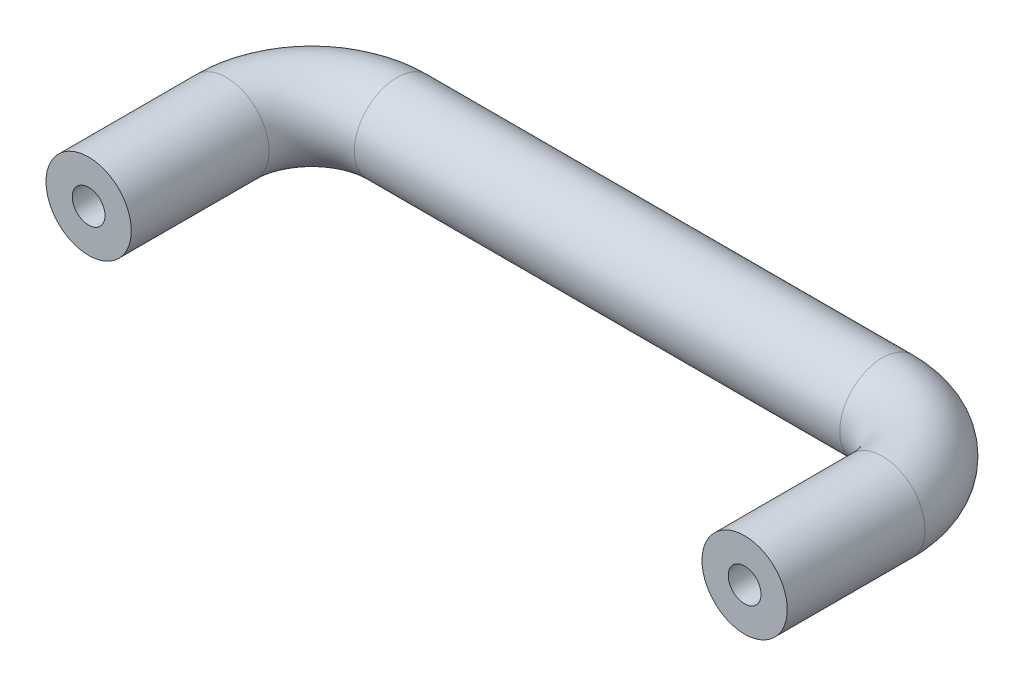
ISO-10303-21;
HEADER;
FILE_DESCRIPTION(('STEP AP214'),'2;1');
FILE_NAME('part.step','',(''),(''),'','','');
FILE_SCHEMA(('AUTOMOTIVE_DESIGN { 1 0 10303 214 1 1 1 1 }'));
ENDSEC;
DATA;
#1=APPLICATION_CONTEXT('core data for automotive mechanical design processes');
#2=APPLICATION_PROTOCOL_DEFINITION('international standard','automotive_design',2000,#1);
#3=PRODUCT_CONTEXT('',#1,'mechanical');
#4=PRODUCT('Part','Part','',(#3));
#5=PRODUCT_RELATED_PRODUCT_CATEGORY('part','',(#4));
#6=PRODUCT_DEFINITION_FORMATION('','',#4);
#7=PRODUCT_DEFINITION_CONTEXT('part definition',#1,'design');
#8=PRODUCT_DEFINITION('design','',#6,#7);
#9=PRODUCT_DEFINITION_SHAPE('','',#8);
#10=(LENGTH_UNIT() NAMED_UNIT(*) SI_UNIT(.MILLI.,.METRE.));
#11=(NAMED_UNIT(*) PLANE_ANGLE_UNIT() SI_UNIT($,.RADIAN.));
#12=(NAMED_UNIT(*) SI_UNIT($,.STERADIAN.) SOLID_ANGLE_UNIT());
#13=UNCERTAINTY_MEASURE_WITH_UNIT(LENGTH_MEASURE(1.E-05),#10,'distance_accuracy_value','');
#14=(GEOMETRIC_REPRESENTATION_CONTEXT(3) GLOBAL_UNCERTAINTY_ASSIGNED_CONTEXT((#13)) GLOBAL_UNIT_ASSIGNED_CONTEXT((#10,
#11,#12)) REPRESENTATION_CONTEXT('',''));
#15=CARTESIAN_POINT('',(0.,0.,0.));
#16=DIRECTION('',(0.,0.,1.));
#17=DIRECTION('',(1.,0.,0.));
#18=AXIS2_PLACEMENT_3D('',#15,#16,#17);
#19=CARTESIAN_POINT('',(50.,0.,34.));
#20=DIRECTION('',(0.,0.,-1.));
#21=DIRECTION('',(-1.,0.,0.));
#22=AXIS2_PLACEMENT_3D('',#19,#20,#21);
#23=PLANE('',#22);
#24=CARTESIAN_POINT('',(50.,0.,34.));
#25=DIRECTION('',(0.,0.,-1.));
#26=DIRECTION('',(-1.,0.,0.));
#27=AXIS2_PLACEMENT_3D('',#24,#25,#26);
#28=CIRCLE('',#27,6.5);
#29=CARTESIAN_POINT('',(43.5,0.,34.));
#30=VERTEX_POINT('',#29);
#31=EDGE_CURVE('E12',#30,#30,#28,.T.);
#32=ORIENTED_EDGE('',*,*,#31,.F.);
#33=EDGE_LOOP('',(#32));
#34=FACE_BOUND('',#33,.T.);
#35=CARTESIAN_POINT('',(50.,0.,34.));
#36=DIRECTION('',(0.,0.,1.));
#37=DIRECTION('',(1.,0.,0.));
#38=AXIS2_PLACEMENT_3D('',#35,#36,#37);
#39=CIRCLE('',#38,2.5);
#40=CARTESIAN_POINT('',(52.5,0.,34.));
#41=VERTEX_POINT('',#40);
#42=EDGE_CURVE('E79',#41,#41,#39,.T.);
#43=ORIENTED_EDGE('',*,*,#42,.F.);
#44=EDGE_LOOP('',(#43));
#45=FACE_BOUND('',#44,.T.);
#46=ADVANCED_FACE('F46',(#34,#45),#23,.F.);
#47=CARTESIAN_POINT('',(-50.,0.,34.));
#48=DIRECTION('',(0.,0.,1.));
#49=DIRECTION('',(1.,0.,0.));
#50=AXIS2_PLACEMENT_3D('',#47,#48,#49);
#51=PLANE('',#50);
#52=CARTESIAN_POINT('',(-50.,0.,34.));
#53=DIRECTION('',(0.,0.,1.));
#54=DIRECTION('',(1.,0.,0.));
#55=AXIS2_PLACEMENT_3D('',#52,#53,#54);
#56=CIRCLE('',#55,2.5);
#57=CARTESIAN_POINT('',(-47.5,0.,34.));
#58=VERTEX_POINT('',#57);
#59=EDGE_CURVE('E80',#58,#58,#56,.T.);
#60=ORIENTED_EDGE('',*,*,#59,.F.);
#61=EDGE_LOOP('',(#60));
#62=FACE_BOUND('',#61,.T.);
#63=CARTESIAN_POINT('',(-50.,0.,34.));
#64=DIRECTION('',(0.,0.,1.));
#65=DIRECTION('',(1.,0.,0.));
#66=AXIS2_PLACEMENT_3D('',#63,#64,#65);
#67=CIRCLE('',#66,6.5);
#68=CARTESIAN_POINT('',(-43.5,0.,34.));
#69=VERTEX_POINT('',#68);
#70=EDGE_CURVE('E59',#69,#69,#67,.T.);
#71=ORIENTED_EDGE('',*,*,#70,.T.);
#72=EDGE_LOOP('',(#71));
#73=FACE_BOUND('',#72,.T.);
#74=ADVANCED_FACE('F48',(#62,#73),#51,.T.);
#75=CARTESIAN_POINT('',(-50.,0.,34.));
#76=DIRECTION('',(0.,0.,-1.));
#77=DIRECTION('',(-1.,0.,0.));
#78=AXIS2_PLACEMENT_3D('',#75,#76,#77);
#79=CYLINDRICAL_SURFACE('',#78,6.5);
#80=CARTESIAN_POINT('',(-50.,0.,13.));
#81=DIRECTION('',(0.,0.,1.));
#82=DIRECTION('',(1.,0.,0.));
#83=AXIS2_PLACEMENT_3D('',#80,#81,#82);
#84=CIRCLE('',#83,6.5);
#85=CARTESIAN_POINT('',(-56.5,0.,13.));
#86=VERTEX_POINT('',#85);
#87=EDGE_CURVE('E91',#86,#86,#84,.T.);
#88=ORIENTED_EDGE('',*,*,#87,.T.);
#89=EDGE_LOOP('',(#88));
#90=FACE_BOUND('',#89,.T.);
#91=ORIENTED_EDGE('',*,*,#70,.F.);
#92=EDGE_LOOP('',(#91));
#93=FACE_BOUND('',#92,.T.);
#94=ADVANCED_FACE('F122',(#90,#93),#79,.T.);
#95=CARTESIAN_POINT('',(-37.,0.,13.));
#96=DIRECTION('',(0.,-1.,0.));
#97=DIRECTION('',(0.,0.,-1.));
#98=AXIS2_PLACEMENT_3D('',#95,#96,#97);
#99=TOROIDAL_SURFACE('',#98,13.,6.5);
#100=CARTESIAN_POINT('',(-37.,0.,0.));
#101=DIRECTION('',(-1.,0.,0.));
#102=DIRECTION('',(0.,0.,1.));
#103=AXIS2_PLACEMENT_3D('',#100,#101,#102);
#104=CIRCLE('',#103,6.5);
#105=CARTESIAN_POINT('',(-37.,0.,-6.49999999999999));
#106=VERTEX_POINT('',#105);
#107=EDGE_CURVE('E94',#106,#106,#104,.T.);
#108=CARTESIAN_POINT('',(-37.,0.,13.));
#109=DIRECTION('',(0.,-1.,0.));
#110=DIRECTION('',(0.,0.,-1.));
#111=AXIS2_PLACEMENT_3D('',#108,#109,#110);
#112=CIRCLE('',#111,19.5);
#113=EDGE_CURVE('',#86,#106,#112,.T.);
#114=ORIENTED_EDGE('',*,*,#87,.F.);
#115=ORIENTED_EDGE('',*,*,#107,.T.);
#116=ORIENTED_EDGE('',*,*,#113,.T.);
#117=ORIENTED_EDGE('',*,*,#113,.F.);
#118=EDGE_LOOP('',(#114,#116,#115,#117));
#119=FACE_BOUND('',#118,.T.);
#120=ADVANCED_FACE('F137',(#119),#99,.T.);
#121=CARTESIAN_POINT('',(-37.,0.,0.));
#122=DIRECTION('',(1.,0.,0.));
#123=DIRECTION('',(0.,0.,-1.));
#124=AXIS2_PLACEMENT_3D('',#121,#122,#123);
#125=CYLINDRICAL_SURFACE('',#124,6.5);
#126=CARTESIAN_POINT('',(37.,0.,0.));
#127=DIRECTION('',(-1.,0.,0.));
#128=DIRECTION('',(0.,0.,1.));
#129=AXIS2_PLACEMENT_3D('',#126,#127,#128);
#130=CIRCLE('',#129,6.5);
#131=CARTESIAN_POINT('',(37.,0.,-6.49999999999999));
#132=VERTEX_POINT('',#131);
#133=EDGE_CURVE('E97',#132,#132,#130,.T.);
#134=ORIENTED_EDGE('',*,*,#133,.T.);
#135=EDGE_LOOP('',(#134));
#136=FACE_BOUND('',#135,.T.);
#137=ORIENTED_EDGE('',*,*,#107,.F.);
#138=EDGE_LOOP('',(#137));
#139=FACE_BOUND('',#138,.T.);
#140=ADVANCED_FACE('F115',(#136,#139),#125,.T.);
#141=CARTESIAN_POINT('',(37.,0.,13.));
#142=DIRECTION('',(0.,-1.,0.));
#143=DIRECTION('',(0.,0.,-1.));
#144=AXIS2_PLACEMENT_3D('',#141,#142,#143);
#145=TOROIDAL_SURFACE('',#144,13.,6.5);
#146=CARTESIAN_POINT('',(50.,0.,13.));
#147=DIRECTION('',(0.,0.,-1.));
#148=DIRECTION('',(-1.,0.,0.));
#149=AXIS2_PLACEMENT_3D('',#146,#147,#148);
#150=CIRCLE('',#149,6.5);
#151=CARTESIAN_POINT('',(56.5,0.,13.));
#152=VERTEX_POINT('',#151);
#153=EDGE_CURVE('E54',#152,#152,#150,.T.);
#154=CARTESIAN_POINT('',(37.,0.,13.));
#155=DIRECTION('',(0.,-1.,0.));
#156=DIRECTION('',(0.,0.,-1.));
#157=AXIS2_PLACEMENT_3D('',#154,#155,#156);
#158=CIRCLE('',#157,19.5);
#159=EDGE_CURVE('',#132,#152,#158,.T.);
#160=ORIENTED_EDGE('',*,*,#133,.F.);
#161=ORIENTED_EDGE('',*,*,#153,.T.);
#162=ORIENTED_EDGE('',*,*,#159,.T.);
#163=ORIENTED_EDGE('',*,*,#159,.F.);
#164=EDGE_LOOP('',(#160,#162,#161,#163));
#165=FACE_BOUND('',#164,.T.);
#166=ADVANCED_FACE('F102',(#165),#145,.T.);
#167=CARTESIAN_POINT('',(50.,0.,13.));
#168=DIRECTION('',(0.,0.,1.));
#169=DIRECTION('',(1.,0.,0.));
#170=AXIS2_PLACEMENT_3D('',#167,#168,#169);
#171=CYLINDRICAL_SURFACE('',#170,6.5);
#172=ORIENTED_EDGE('',*,*,#31,.T.);
#173=EDGE_LOOP('',(#172));
#174=FACE_BOUND('',#173,.T.);
#175=ORIENTED_EDGE('',*,*,#153,.F.);
#176=EDGE_LOOP('',(#175));
#177=FACE_BOUND('',#176,.T.);
#178=ADVANCED_FACE('F105',(#174,#177),#171,.T.);
#179=CARTESIAN_POINT('',(50.,0.,12.));
#180=DIRECTION('',(0.,0.,1.));
#181=DIRECTION('',(1.,0.,0.));
#182=AXIS2_PLACEMENT_3D('',#179,#180,#181);
#183=CONICAL_SURFACE('',#182,2.5,1.02974425867665);
#184=CARTESIAN_POINT('',(50.,0.,10.4978484524311));
#185=VERTEX_POINT('',#184);
#186=VERTEX_LOOP('',#185);
#187=FACE_BOUND('',#186,.T.);
#188=CARTESIAN_POINT('',(50.,0.,12.));
#189=DIRECTION('',(0.,0.,1.));
#190=DIRECTION('',(1.,0.,0.));
#191=AXIS2_PLACEMENT_3D('',#188,#189,#190);
#192=CIRCLE('',#191,2.5);
#193=CARTESIAN_POINT('',(52.5,0.,12.));
#194=VERTEX_POINT('',#193);
#195=EDGE_CURVE('E83',#194,#194,#192,.T.);
#196=ORIENTED_EDGE('',*,*,#195,.T.);
#197=EDGE_LOOP('',(#196));
#198=FACE_BOUND('',#197,.T.);
#199=ADVANCED_FACE('F107',(#187,#198),#183,.F.);
#200=CARTESIAN_POINT('',(50.,0.,34.));
#201=DIRECTION('',(0.,0.,1.));
#202=DIRECTION('',(1.,0.,0.));
#203=AXIS2_PLACEMENT_3D('',#200,#201,#202);
#204=CYLINDRICAL_SURFACE('',#203,2.5);
#205=ORIENTED_EDGE('',*,*,#195,.F.);
#206=EDGE_LOOP('',(#205));
#207=FACE_BOUND('',#206,.T.);
#208=ORIENTED_EDGE('',*,*,#42,.T.);
#209=EDGE_LOOP('',(#208));
#210=FACE_BOUND('',#209,.T.);
#211=ADVANCED_FACE('F73',(#207,#210),#204,.F.);
#212=CARTESIAN_POINT('',(-50.,0.,12.));
#213=DIRECTION('',(0.,0.,1.));
#214=DIRECTION('',(1.,0.,0.));
#215=AXIS2_PLACEMENT_3D('',#212,#213,#214);
#216=CONICAL_SURFACE('',#215,2.5,1.02974425867665);
#217=CARTESIAN_POINT('',(-50.,0.,10.4978484524311));
#218=VERTEX_POINT('',#217);
#219=VERTEX_LOOP('',#218);
#220=FACE_BOUND('',#219,.T.);
#221=CARTESIAN_POINT('',(-50.,0.,12.));
#222=DIRECTION('',(0.,0.,1.));
#223=DIRECTION('',(1.,0.,0.));
#224=AXIS2_PLACEMENT_3D('',#221,#222,#223);
#225=CIRCLE('',#224,2.5);
#226=CARTESIAN_POINT('',(-47.5,0.,12.));
#227=VERTEX_POINT('',#226);
#228=EDGE_CURVE('E77',#227,#227,#225,.T.);
#229=ORIENTED_EDGE('',*,*,#228,.T.);
#230=EDGE_LOOP('',(#229));
#231=FACE_BOUND('',#230,.T.);
#232=ADVANCED_FACE('F69',(#220,#231),#216,.F.);
#233=CARTESIAN_POINT('',(-50.,0.,34.));
#234=DIRECTION('',(0.,0.,1.));
#235=DIRECTION('',(1.,0.,0.));
#236=AXIS2_PLACEMENT_3D('',#233,#234,#235);
#237=CYLINDRICAL_SURFACE('',#236,2.5);
#238=ORIENTED_EDGE('',*,*,#228,.F.);
#239=EDGE_LOOP('',(#238));
#240=FACE_BOUND('',#239,.T.);
#241=ORIENTED_EDGE('',*,*,#59,.T.);
#242=EDGE_LOOP('',(#241));
#243=FACE_BOUND('',#242,.T.);
#244=ADVANCED_FACE('F72',(#240,#243),#237,.F.);
#245=CLOSED_SHELL('',(#46,#74,#94,#120,#140,#166,#178,#199,#211,#232,#244));
#246=MANIFOLD_SOLID_BREP('B2',#245);
#247=ADVANCED_BREP_SHAPE_REPRESENTATION('',(#18,#246),#14);
#248=SHAPE_DEFINITION_REPRESENTATION(#9,#247);
ENDSEC;
END-ISO-10303-21;
